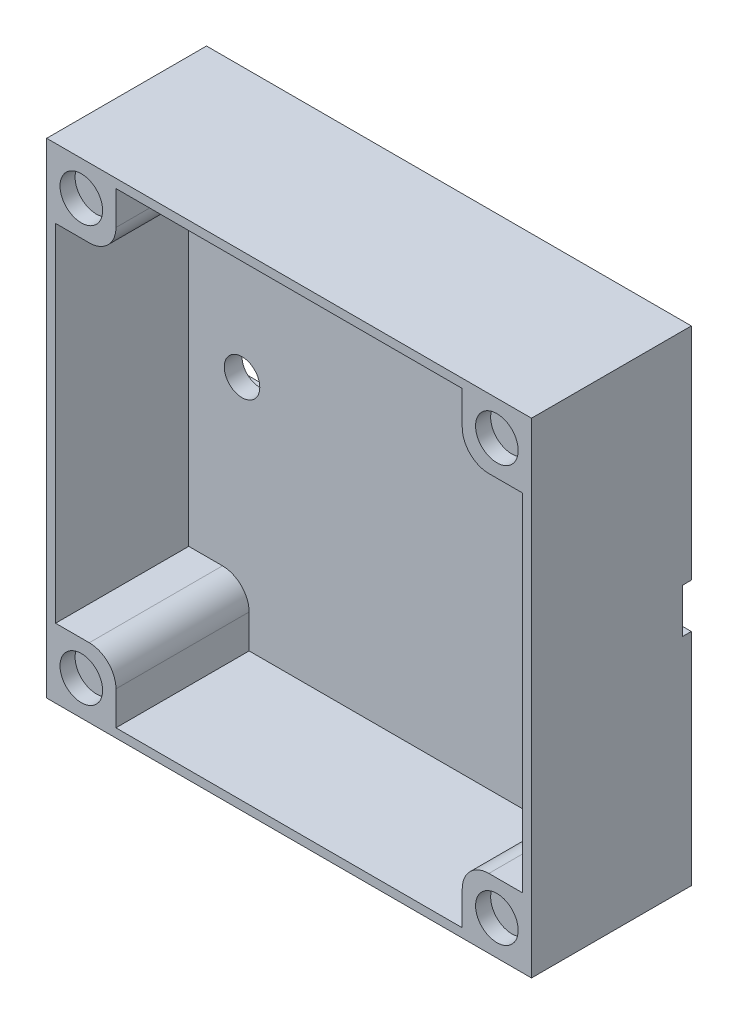
ISO-10303-21;
HEADER;
FILE_DESCRIPTION(('STEP AP214'),'2;1');
FILE_NAME('part.step','',(''),(''),'','','');
FILE_SCHEMA(('AUTOMOTIVE_DESIGN { 1 0 10303 214 1 1 1 1 }'));
ENDSEC;
DATA;
#1=APPLICATION_CONTEXT('core data for automotive mechanical design processes');
#2=APPLICATION_PROTOCOL_DEFINITION('international standard','automotive_design',2000,#1);
#3=PRODUCT_CONTEXT('',#1,'mechanical');
#4=PRODUCT('Part','Part','',(#3));
#5=PRODUCT_RELATED_PRODUCT_CATEGORY('part','',(#4));
#6=PRODUCT_DEFINITION_FORMATION('','',#4);
#7=PRODUCT_DEFINITION_CONTEXT('part definition',#1,'design');
#8=PRODUCT_DEFINITION('design','',#6,#7);
#9=PRODUCT_DEFINITION_SHAPE('','',#8);
#10=(LENGTH_UNIT() NAMED_UNIT(*) SI_UNIT(.MILLI.,.METRE.));
#11=(NAMED_UNIT(*) PLANE_ANGLE_UNIT() SI_UNIT($,.RADIAN.));
#12=(NAMED_UNIT(*) SI_UNIT($,.STERADIAN.) SOLID_ANGLE_UNIT());
#13=UNCERTAINTY_MEASURE_WITH_UNIT(LENGTH_MEASURE(1.E-05),#10,'distance_accuracy_value','');
#14=(GEOMETRIC_REPRESENTATION_CONTEXT(3) GLOBAL_UNCERTAINTY_ASSIGNED_CONTEXT((#13)) GLOBAL_UNIT_ASSIGNED_CONTEXT((#10,
#11,#12)) REPRESENTATION_CONTEXT('',''));
#15=CARTESIAN_POINT('',(0.,0.,0.));
#16=DIRECTION('',(0.,0.,1.));
#17=DIRECTION('',(1.,0.,0.));
#18=AXIS2_PLACEMENT_3D('',#15,#16,#17);
#19=CARTESIAN_POINT('',(27.3,27.3,3.));
#20=DIRECTION('',(1.,0.,0.));
#21=DIRECTION('',(0.,1.,0.));
#22=AXIS2_PLACEMENT_3D('',#19,#20,#21);
#23=PLANE('',#22);
#24=DIRECTION('',(0.,0.,-1.));
#25=VECTOR('',#24,1.);
#26=CARTESIAN_POINT('',(27.3,27.3,3.));
#27=LINE('',#26,#25);
#28=CARTESIAN_POINT('',(27.3,27.3,18.));
#29=VERTEX_POINT('',#28);
#30=CARTESIAN_POINT('',(27.3,27.3,0.));
#31=VERTEX_POINT('',#30);
#32=EDGE_CURVE('E371',#29,#31,#27,.T.);
#33=ORIENTED_EDGE('',*,*,#32,.F.);
#34=DIRECTION('',(0.,1.,0.));
#35=VECTOR('',#34,1.);
#36=CARTESIAN_POINT('',(27.3,0.,18.));
#37=LINE('',#36,#35);
#38=CARTESIAN_POINT('',(27.3,-27.3,18.));
#39=VERTEX_POINT('',#38);
#40=EDGE_CURVE('E312',#39,#29,#37,.T.);
#41=ORIENTED_EDGE('',*,*,#40,.F.);
#42=DIRECTION('',(0.,0.,-1.));
#43=VECTOR('',#42,1.);
#44=CARTESIAN_POINT('',(27.3,-27.3,3.));
#45=LINE('',#44,#43);
#46=CARTESIAN_POINT('',(27.3,-27.3,0.));
#47=VERTEX_POINT('',#46);
#48=EDGE_CURVE('E367',#39,#47,#45,.T.);
#49=ORIENTED_EDGE('',*,*,#48,.T.);
#50=DIRECTION('',(0.,-1.,0.));
#51=VECTOR('',#50,1.);
#52=CARTESIAN_POINT('',(27.3,27.3,0.));
#53=LINE('',#52,#51);
#54=CARTESIAN_POINT('',(27.3,-2.5,0.));
#55=VERTEX_POINT('',#54);
#56=EDGE_CURVE('E363',#55,#47,#53,.T.);
#57=ORIENTED_EDGE('',*,*,#56,.F.);
#58=DIRECTION('',(0.,0.,-1.));
#59=VECTOR('',#58,1.);
#60=CARTESIAN_POINT('',(27.3,-2.5,1.));
#61=LINE('',#60,#59);
#62=CARTESIAN_POINT('',(27.3,-2.5,1.));
#63=VERTEX_POINT('',#62);
#64=EDGE_CURVE('E342',#63,#55,#61,.T.);
#65=ORIENTED_EDGE('',*,*,#64,.F.);
#66=DIRECTION('',(0.,-1.,0.));
#67=VECTOR('',#66,1.);
#68=CARTESIAN_POINT('',(27.3,2.5,1.));
#69=LINE('',#68,#67);
#70=CARTESIAN_POINT('',(27.3,2.5,1.));
#71=VERTEX_POINT('',#70);
#72=EDGE_CURVE('E330',#71,#63,#69,.T.);
#73=ORIENTED_EDGE('',*,*,#72,.F.);
#74=DIRECTION('',(0.,0.,-1.));
#75=VECTOR('',#74,1.);
#76=CARTESIAN_POINT('',(27.3,2.5,1.));
#77=LINE('',#76,#75);
#78=CARTESIAN_POINT('',(27.3,2.5,0.));
#79=VERTEX_POINT('',#78);
#80=EDGE_CURVE('E346',#71,#79,#77,.T.);
#81=ORIENTED_EDGE('',*,*,#80,.T.);
#82=EDGE_CURVE('E364',#31,#79,#53,.T.);
#83=ORIENTED_EDGE('',*,*,#82,.F.);
#84=EDGE_LOOP('',(#33,#41,#49,#57,#65,#73,#81,#83));
#85=FACE_BOUND('',#84,.T.);
#86=ADVANCED_FACE('F71',(#85),#23,.T.);
#87=CARTESIAN_POINT('',(-27.3,27.3,3.));
#88=DIRECTION('',(1.,0.,0.));
#89=DIRECTION('',(0.,1.,0.));
#90=AXIS2_PLACEMENT_3D('',#87,#88,#89);
#91=PLANE('',#90);
#92=DIRECTION('',(0.,-1.,0.));
#93=VECTOR('',#92,1.);
#94=CARTESIAN_POINT('',(-27.3,27.3,0.));
#95=LINE('',#94,#93);
#96=CARTESIAN_POINT('',(-27.3,-2.5,0.));
#97=VERTEX_POINT('',#96);
#98=CARTESIAN_POINT('',(-27.3,-27.3,0.));
#99=VERTEX_POINT('',#98);
#100=EDGE_CURVE('E358',#97,#99,#95,.T.);
#101=ORIENTED_EDGE('',*,*,#100,.T.);
#102=DIRECTION('',(0.,0.,-1.));
#103=VECTOR('',#102,1.);
#104=CARTESIAN_POINT('',(-27.3,-27.3,3.));
#105=LINE('',#104,#103);
#106=CARTESIAN_POINT('',(-27.3,-27.3,18.));
#107=VERTEX_POINT('',#106);
#108=EDGE_CURVE('E366',#107,#99,#105,.T.);
#109=ORIENTED_EDGE('',*,*,#108,.F.);
#110=DIRECTION('',(0.,-1.,0.));
#111=VECTOR('',#110,1.);
#112=CARTESIAN_POINT('',(-27.3,0.,18.));
#113=LINE('',#112,#111);
#114=CARTESIAN_POINT('',(-27.3,27.3,18.));
#115=VERTEX_POINT('',#114);
#116=EDGE_CURVE('E316',#115,#107,#113,.T.);
#117=ORIENTED_EDGE('',*,*,#116,.F.);
#118=DIRECTION('',(0.,0.,-1.));
#119=VECTOR('',#118,1.);
#120=CARTESIAN_POINT('',(-27.3,27.3,3.));
#121=LINE('',#120,#119);
#122=CARTESIAN_POINT('',(-27.3,27.3,0.));
#123=VERTEX_POINT('',#122);
#124=EDGE_CURVE('E373',#115,#123,#121,.T.);
#125=ORIENTED_EDGE('',*,*,#124,.T.);
#126=CARTESIAN_POINT('',(-27.3,2.5,0.));
#127=VERTEX_POINT('',#126);
#128=EDGE_CURVE('E359',#123,#127,#95,.T.);
#129=ORIENTED_EDGE('',*,*,#128,.T.);
#130=DIRECTION('',(0.,0.,-1.));
#131=VECTOR('',#130,1.);
#132=CARTESIAN_POINT('',(-27.3,2.5,1.));
#133=LINE('',#132,#131);
#134=CARTESIAN_POINT('',(-27.3,2.5,1.));
#135=VERTEX_POINT('',#134);
#136=EDGE_CURVE('E350',#135,#127,#133,.T.);
#137=ORIENTED_EDGE('',*,*,#136,.F.);
#138=DIRECTION('',(0.,-1.,0.));
#139=VECTOR('',#138,1.);
#140=CARTESIAN_POINT('',(-27.3,2.5,1.));
#141=LINE('',#140,#139);
#142=CARTESIAN_POINT('',(-27.3,-2.5,1.));
#143=VERTEX_POINT('',#142);
#144=EDGE_CURVE('E337',#135,#143,#141,.T.);
#145=ORIENTED_EDGE('',*,*,#144,.T.);
#146=DIRECTION('',(0.,0.,-1.));
#147=VECTOR('',#146,1.);
#148=CARTESIAN_POINT('',(-27.3,-2.5,1.));
#149=LINE('',#148,#147);
#150=EDGE_CURVE('E353',#143,#97,#149,.T.);
#151=ORIENTED_EDGE('',*,*,#150,.T.);
#152=EDGE_LOOP('',(#101,#109,#117,#125,#129,#137,#145,#151));
#153=FACE_BOUND('',#152,.T.);
#154=ADVANCED_FACE('F494',(#153),#91,.F.);
#155=CARTESIAN_POINT('',(0.,0.,0.));
#156=DIRECTION('',(0.,0.,1.));
#157=DIRECTION('',(1.,0.,0.));
#158=AXIS2_PLACEMENT_3D('',#155,#156,#157);
#159=PLANE('',#158);
#160=DIRECTION('',(-1.,0.,0.));
#161=VECTOR('',#160,1.);
#162=CARTESIAN_POINT('',(27.3,2.5,0.));
#163=LINE('',#162,#161);
#164=EDGE_CURVE('E334',#79,#127,#163,.T.);
#165=ORIENTED_EDGE('',*,*,#164,.T.);
#166=ORIENTED_EDGE('',*,*,#128,.F.);
#167=DIRECTION('',(-1.,0.,0.));
#168=VECTOR('',#167,1.);
#169=CARTESIAN_POINT('',(27.3,27.3,0.));
#170=LINE('',#169,#168);
#171=EDGE_CURVE('E361',#31,#123,#170,.T.);
#172=ORIENTED_EDGE('',*,*,#171,.F.);
#173=ORIENTED_EDGE('',*,*,#82,.T.);
#174=EDGE_LOOP('',(#165,#166,#172,#173));
#175=FACE_BOUND('',#174,.T.);
#176=ADVANCED_FACE('F500',(#175),#159,.F.);
#177=CARTESIAN_POINT('',(27.3,-27.3,3.));
#178=DIRECTION('',(0.,-1.,0.));
#179=DIRECTION('',(1.,0.,0.));
#180=AXIS2_PLACEMENT_3D('',#177,#178,#179);
#181=PLANE('',#180);
#182=ORIENTED_EDGE('',*,*,#48,.F.);
#183=DIRECTION('',(1.,0.,0.));
#184=VECTOR('',#183,1.);
#185=CARTESIAN_POINT('',(0.,-27.3,18.));
#186=LINE('',#185,#184);
#187=EDGE_CURVE('E310',#107,#39,#186,.T.);
#188=ORIENTED_EDGE('',*,*,#187,.F.);
#189=ORIENTED_EDGE('',*,*,#108,.T.);
#190=DIRECTION('',(-1.,0.,0.));
#191=VECTOR('',#190,1.);
#192=CARTESIAN_POINT('',(27.3,-27.3,0.));
#193=LINE('',#192,#191);
#194=EDGE_CURVE('E349',#47,#99,#193,.T.);
#195=ORIENTED_EDGE('',*,*,#194,.F.);
#196=EDGE_LOOP('',(#182,#188,#189,#195));
#197=FACE_BOUND('',#196,.T.);
#198=ADVANCED_FACE('F510',(#197),#181,.T.);
#199=CARTESIAN_POINT('',(27.3,27.3,3.));
#200=DIRECTION('',(0.,-1.,0.));
#201=DIRECTION('',(1.,0.,0.));
#202=AXIS2_PLACEMENT_3D('',#199,#200,#201);
#203=PLANE('',#202);
#204=ORIENTED_EDGE('',*,*,#171,.T.);
#205=ORIENTED_EDGE('',*,*,#124,.F.);
#206=DIRECTION('',(-1.,0.,0.));
#207=VECTOR('',#206,1.);
#208=CARTESIAN_POINT('',(0.,27.3,18.));
#209=LINE('',#208,#207);
#210=EDGE_CURVE('E314',#29,#115,#209,.T.);
#211=ORIENTED_EDGE('',*,*,#210,.F.);
#212=ORIENTED_EDGE('',*,*,#32,.T.);
#213=EDGE_LOOP('',(#204,#205,#211,#212));
#214=FACE_BOUND('',#213,.T.);
#215=ADVANCED_FACE('F508',(#214),#203,.F.);
#216=ORIENTED_EDGE('',*,*,#194,.T.);
#217=ORIENTED_EDGE('',*,*,#100,.F.);
#218=DIRECTION('',(-1.,0.,0.));
#219=VECTOR('',#218,1.);
#220=CARTESIAN_POINT('',(27.3,-2.5,0.));
#221=LINE('',#220,#219);
#222=EDGE_CURVE('E319',#55,#97,#221,.T.);
#223=ORIENTED_EDGE('',*,*,#222,.F.);
#224=ORIENTED_EDGE('',*,*,#56,.T.);
#225=EDGE_LOOP('',(#216,#217,#223,#224));
#226=FACE_BOUND('',#225,.T.);
#227=ADVANCED_FACE('F506',(#226),#159,.F.);
#228=CARTESIAN_POINT('',(27.3,2.5,1.));
#229=DIRECTION('',(0.,-1.,0.));
#230=DIRECTION('',(0.,0.,-1.));
#231=AXIS2_PLACEMENT_3D('',#228,#229,#230);
#232=PLANE('',#231);
#233=ORIENTED_EDGE('',*,*,#164,.F.);
#234=ORIENTED_EDGE('',*,*,#80,.F.);
#235=DIRECTION('',(-1.,0.,0.));
#236=VECTOR('',#235,1.);
#237=CARTESIAN_POINT('',(27.3,2.5,1.));
#238=LINE('',#237,#236);
#239=EDGE_CURVE('E340',#71,#135,#238,.T.);
#240=ORIENTED_EDGE('',*,*,#239,.T.);
#241=ORIENTED_EDGE('',*,*,#136,.T.);
#242=EDGE_LOOP('',(#233,#234,#240,#241));
#243=FACE_BOUND('',#242,.T.);
#244=ADVANCED_FACE('F581',(#243),#232,.T.);
#245=CARTESIAN_POINT('',(27.3,-2.5,1.));
#246=DIRECTION('',(0.,-1.,0.));
#247=DIRECTION('',(0.,0.,-1.));
#248=AXIS2_PLACEMENT_3D('',#245,#246,#247);
#249=PLANE('',#248);
#250=ORIENTED_EDGE('',*,*,#222,.T.);
#251=ORIENTED_EDGE('',*,*,#150,.F.);
#252=DIRECTION('',(-1.,0.,0.));
#253=VECTOR('',#252,1.);
#254=CARTESIAN_POINT('',(27.3,-2.5,1.));
#255=LINE('',#254,#253);
#256=EDGE_CURVE('E333',#63,#143,#255,.T.);
#257=ORIENTED_EDGE('',*,*,#256,.F.);
#258=ORIENTED_EDGE('',*,*,#64,.T.);
#259=EDGE_LOOP('',(#250,#251,#257,#258));
#260=FACE_BOUND('',#259,.T.);
#261=ADVANCED_FACE('F576',(#260),#249,.F.);
#262=CARTESIAN_POINT('',(0.,0.,1.));
#263=DIRECTION('',(0.,0.,-1.));
#264=DIRECTION('',(-1.,0.,0.));
#265=AXIS2_PLACEMENT_3D('',#262,#263,#264);
#266=PLANE('',#265);
#267=CARTESIAN_POINT('',(20.3,0.,1.));
#268=DIRECTION('',(0.,0.,-1.));
#269=DIRECTION('',(-1.,0.,0.));
#270=AXIS2_PLACEMENT_3D('',#267,#268,#269);
#271=CIRCLE('',#270,2.);
#272=CARTESIAN_POINT('',(18.3,0.,1.));
#273=VERTEX_POINT('',#272);
#274=EDGE_CURVE('E299',#273,#273,#271,.T.);
#275=ORIENTED_EDGE('',*,*,#274,.F.);
#276=EDGE_LOOP('',(#275));
#277=FACE_BOUND('',#276,.T.);
#278=CARTESIAN_POINT('',(-20.3,0.,1.));
#279=DIRECTION('',(0.,0.,-1.));
#280=DIRECTION('',(-1.,0.,0.));
#281=AXIS2_PLACEMENT_3D('',#278,#279,#280);
#282=CIRCLE('',#281,2.);
#283=CARTESIAN_POINT('',(-22.3,0.,1.));
#284=VERTEX_POINT('',#283);
#285=EDGE_CURVE('E298',#284,#284,#282,.T.);
#286=ORIENTED_EDGE('',*,*,#285,.F.);
#287=EDGE_LOOP('',(#286));
#288=FACE_BOUND('',#287,.T.);
#289=ORIENTED_EDGE('',*,*,#72,.T.);
#290=ORIENTED_EDGE('',*,*,#256,.T.);
#291=ORIENTED_EDGE('',*,*,#144,.F.);
#292=ORIENTED_EDGE('',*,*,#239,.F.);
#293=EDGE_LOOP('',(#289,#290,#291,#292));
#294=FACE_BOUND('',#293,.T.);
#295=ADVANCED_FACE('F566',(#277,#288,#294),#266,.T.);
#296=CARTESIAN_POINT('',(26.3,0.,18.));
#297=DIRECTION('',(1.,0.,0.));
#298=DIRECTION('',(0.,1.,0.));
#299=AXIS2_PLACEMENT_3D('',#296,#297,#298);
#300=PLANE('',#299);
#301=DIRECTION('',(0.,-1.,0.));
#302=VECTOR('',#301,1.);
#303=CARTESIAN_POINT('',(26.3,0.,3.));
#304=LINE('',#303,#302);
#305=CARTESIAN_POINT('',(26.3,19.5,3.));
#306=VERTEX_POINT('',#305);
#307=CARTESIAN_POINT('',(26.3,-19.5,3.));
#308=VERTEX_POINT('',#307);
#309=EDGE_CURVE('E252',#306,#308,#304,.T.);
#310=ORIENTED_EDGE('',*,*,#309,.T.);
#311=DIRECTION('',(0.,0.,1.));
#312=VECTOR('',#311,1.);
#313=CARTESIAN_POINT('',(26.3,-19.5,18.));
#314=LINE('',#313,#312);
#315=CARTESIAN_POINT('',(26.3,-19.5,18.));
#316=VERTEX_POINT('',#315);
#317=EDGE_CURVE('E274',#308,#316,#314,.T.);
#318=ORIENTED_EDGE('',*,*,#317,.T.);
#319=DIRECTION('',(0.,-1.,0.));
#320=VECTOR('',#319,1.);
#321=CARTESIAN_POINT('',(26.3,0.,18.));
#322=LINE('',#321,#320);
#323=CARTESIAN_POINT('',(26.3,19.5,18.));
#324=VERTEX_POINT('',#323);
#325=EDGE_CURVE('E307',#324,#316,#322,.T.);
#326=ORIENTED_EDGE('',*,*,#325,.F.);
#327=DIRECTION('',(0.,0.,-1.));
#328=VECTOR('',#327,1.);
#329=CARTESIAN_POINT('',(26.3,19.5,18.));
#330=LINE('',#329,#328);
#331=EDGE_CURVE('E292',#324,#306,#330,.T.);
#332=ORIENTED_EDGE('',*,*,#331,.T.);
#333=EDGE_LOOP('',(#310,#318,#326,#332));
#334=FACE_BOUND('',#333,.T.);
#335=ADVANCED_FACE('F552',(#334),#300,.F.);
#336=CARTESIAN_POINT('',(-26.3,0.,18.));
#337=DIRECTION('',(1.,0.,0.));
#338=DIRECTION('',(0.,1.,0.));
#339=AXIS2_PLACEMENT_3D('',#336,#337,#338);
#340=PLANE('',#339);
#341=DIRECTION('',(0.,0.,1.));
#342=VECTOR('',#341,1.);
#343=CARTESIAN_POINT('',(-26.3,-19.5,18.));
#344=LINE('',#343,#342);
#345=CARTESIAN_POINT('',(-26.3,-19.5,3.));
#346=VERTEX_POINT('',#345);
#347=CARTESIAN_POINT('',(-26.3,-19.5,18.));
#348=VERTEX_POINT('',#347);
#349=EDGE_CURVE('E236',#346,#348,#344,.T.);
#350=ORIENTED_EDGE('',*,*,#349,.F.);
#351=DIRECTION('',(0.,-1.,0.));
#352=VECTOR('',#351,1.);
#353=CARTESIAN_POINT('',(-26.3,0.,3.));
#354=LINE('',#353,#352);
#355=CARTESIAN_POINT('',(-26.3,19.5,3.));
#356=VERTEX_POINT('',#355);
#357=EDGE_CURVE('E244',#356,#346,#354,.T.);
#358=ORIENTED_EDGE('',*,*,#357,.F.);
#359=DIRECTION('',(0.,0.,-1.));
#360=VECTOR('',#359,1.);
#361=CARTESIAN_POINT('',(-26.3,19.5,18.));
#362=LINE('',#361,#360);
#363=CARTESIAN_POINT('',(-26.3,19.5,18.));
#364=VERTEX_POINT('',#363);
#365=EDGE_CURVE('E285',#364,#356,#362,.T.);
#366=ORIENTED_EDGE('',*,*,#365,.F.);
#367=DIRECTION('',(0.,-1.,0.));
#368=VECTOR('',#367,1.);
#369=CARTESIAN_POINT('',(-26.3,0.,18.));
#370=LINE('',#369,#368);
#371=EDGE_CURVE('E256',#364,#348,#370,.T.);
#372=ORIENTED_EDGE('',*,*,#371,.T.);
#373=EDGE_LOOP('',(#350,#358,#366,#372));
#374=FACE_BOUND('',#373,.T.);
#375=ADVANCED_FACE('F254',(#374),#340,.T.);
#376=CARTESIAN_POINT('',(0.,26.3,18.));
#377=DIRECTION('',(0.,1.,0.));
#378=DIRECTION('',(0.,0.,1.));
#379=AXIS2_PLACEMENT_3D('',#376,#377,#378);
#380=PLANE('',#379);
#381=DIRECTION('',(1.,0.,0.));
#382=VECTOR('',#381,1.);
#383=CARTESIAN_POINT('',(0.,26.3,18.));
#384=LINE('',#383,#382);
#385=CARTESIAN_POINT('',(-19.5,26.3,18.));
#386=VERTEX_POINT('',#385);
#387=CARTESIAN_POINT('',(19.5,26.3,18.));
#388=VERTEX_POINT('',#387);
#389=EDGE_CURVE('E251',#386,#388,#384,.T.);
#390=ORIENTED_EDGE('',*,*,#389,.F.);
#391=DIRECTION('',(0.,0.,-1.));
#392=VECTOR('',#391,1.);
#393=CARTESIAN_POINT('',(-19.5,26.3,18.));
#394=LINE('',#393,#392);
#395=CARTESIAN_POINT('',(-19.5,26.3,3.));
#396=VERTEX_POINT('',#395);
#397=EDGE_CURVE('E282',#386,#396,#394,.T.);
#398=ORIENTED_EDGE('',*,*,#397,.T.);
#399=DIRECTION('',(1.,0.,0.));
#400=VECTOR('',#399,1.);
#401=CARTESIAN_POINT('',(0.,26.3,3.));
#402=LINE('',#401,#400);
#403=CARTESIAN_POINT('',(19.5,26.3,3.));
#404=VERTEX_POINT('',#403);
#405=EDGE_CURVE('E320',#396,#404,#402,.T.);
#406=ORIENTED_EDGE('',*,*,#405,.T.);
#407=DIRECTION('',(0.,0.,1.));
#408=VECTOR('',#407,1.);
#409=CARTESIAN_POINT('',(19.5,26.3,18.));
#410=LINE('',#409,#408);
#411=EDGE_CURVE('E295',#404,#388,#410,.T.);
#412=ORIENTED_EDGE('',*,*,#411,.T.);
#413=EDGE_LOOP('',(#390,#398,#406,#412));
#414=FACE_BOUND('',#413,.T.);
#415=ADVANCED_FACE('F475',(#414),#380,.F.);
#416=CARTESIAN_POINT('',(0.,0.,18.));
#417=DIRECTION('',(0.,0.,1.));
#418=DIRECTION('',(1.,0.,0.));
#419=AXIS2_PLACEMENT_3D('',#416,#417,#418);
#420=PLANE('',#419);
#421=CARTESIAN_POINT('',(23.4002805646626,-23.4,18.));
#422=DIRECTION('',(0.,0.,1.));
#423=DIRECTION('',(1.,0.,0.));
#424=AXIS2_PLACEMENT_3D('',#421,#422,#423);
#425=CIRCLE('',#424,2.4);
#426=CARTESIAN_POINT('',(25.8002805646626,-23.4,18.));
#427=VERTEX_POINT('',#426);
#428=EDGE_CURVE('E445',#427,#427,#425,.T.);
#429=ORIENTED_EDGE('',*,*,#428,.F.);
#430=EDGE_LOOP('',(#429));
#431=FACE_BOUND('',#430,.T.);
#432=CARTESIAN_POINT('',(23.4002805646626,23.4,18.));
#433=DIRECTION('',(0.,0.,1.));
#434=DIRECTION('',(1.,0.,0.));
#435=AXIS2_PLACEMENT_3D('',#432,#433,#434);
#436=CIRCLE('',#435,2.4);
#437=CARTESIAN_POINT('',(25.8002805646626,23.4,18.));
#438=VERTEX_POINT('',#437);
#439=EDGE_CURVE('E451',#438,#438,#436,.T.);
#440=ORIENTED_EDGE('',*,*,#439,.F.);
#441=EDGE_LOOP('',(#440));
#442=FACE_BOUND('',#441,.T.);
#443=CARTESIAN_POINT('',(-23.4,23.4,18.));
#444=DIRECTION('',(0.,0.,1.));
#445=DIRECTION('',(1.,0.,0.));
#446=AXIS2_PLACEMENT_3D('',#443,#444,#445);
#447=CIRCLE('',#446,2.4);
#448=CARTESIAN_POINT('',(-21.,23.4,18.));
#449=VERTEX_POINT('',#448);
#450=EDGE_CURVE('E457',#449,#449,#447,.T.);
#451=ORIENTED_EDGE('',*,*,#450,.F.);
#452=EDGE_LOOP('',(#451));
#453=FACE_BOUND('',#452,.T.);
#454=CARTESIAN_POINT('',(-23.4,-23.4,18.));
#455=DIRECTION('',(0.,0.,1.));
#456=DIRECTION('',(1.,0.,0.));
#457=AXIS2_PLACEMENT_3D('',#454,#455,#456);
#458=CIRCLE('',#457,2.4);
#459=CARTESIAN_POINT('',(-21.,-23.4,18.));
#460=VERTEX_POINT('',#459);
#461=EDGE_CURVE('E439',#460,#460,#458,.T.);
#462=ORIENTED_EDGE('',*,*,#461,.F.);
#463=EDGE_LOOP('',(#462));
#464=FACE_BOUND('',#463,.T.);
#465=DIRECTION('',(0.,1.,0.));
#466=VECTOR('',#465,1.);
#467=CARTESIAN_POINT('',(19.5,27.3,18.));
#468=LINE('',#467,#466);
#469=CARTESIAN_POINT('',(19.5,22.5,18.));
#470=VERTEX_POINT('',#469);
#471=EDGE_CURVE('E290',#470,#388,#468,.T.);
#472=ORIENTED_EDGE('',*,*,#471,.F.);
#473=CARTESIAN_POINT('',(22.5,22.5,18.));
#474=DIRECTION('',(0.,0.,1.));
#475=DIRECTION('',(1.,0.,0.));
#476=AXIS2_PLACEMENT_3D('',#473,#474,#475);
#477=CIRCLE('',#476,3.);
#478=CARTESIAN_POINT('',(22.5,19.5,18.));
#479=VERTEX_POINT('',#478);
#480=EDGE_CURVE('E406',#470,#479,#477,.T.);
#481=ORIENTED_EDGE('',*,*,#480,.T.);
#482=DIRECTION('',(-1.,0.,0.));
#483=VECTOR('',#482,1.);
#484=CARTESIAN_POINT('',(27.3,19.5,18.));
#485=LINE('',#484,#483);
#486=EDGE_CURVE('E287',#324,#479,#485,.T.);
#487=ORIENTED_EDGE('',*,*,#486,.F.);
#488=ORIENTED_EDGE('',*,*,#325,.T.);
#489=DIRECTION('',(1.,0.,0.));
#490=VECTOR('',#489,1.);
#491=CARTESIAN_POINT('',(27.3,-19.5,18.));
#492=LINE('',#491,#490);
#493=CARTESIAN_POINT('',(22.5,-19.5,18.));
#494=VERTEX_POINT('',#493);
#495=EDGE_CURVE('E269',#494,#316,#492,.T.);
#496=ORIENTED_EDGE('',*,*,#495,.F.);
#497=CARTESIAN_POINT('',(22.5,-22.5,18.));
#498=DIRECTION('',(0.,0.,1.));
#499=DIRECTION('',(1.,0.,0.));
#500=AXIS2_PLACEMENT_3D('',#497,#498,#499);
#501=CIRCLE('',#500,3.);
#502=CARTESIAN_POINT('',(19.5,-22.5,18.));
#503=VERTEX_POINT('',#502);
#504=EDGE_CURVE('E404',#494,#503,#501,.T.);
#505=ORIENTED_EDGE('',*,*,#504,.T.);
#506=DIRECTION('',(0.,1.,0.));
#507=VECTOR('',#506,1.);
#508=CARTESIAN_POINT('',(19.5,-27.3,18.));
#509=LINE('',#508,#507);
#510=CARTESIAN_POINT('',(19.5,-26.3,18.));
#511=VERTEX_POINT('',#510);
#512=EDGE_CURVE('E261',#511,#503,#509,.T.);
#513=ORIENTED_EDGE('',*,*,#512,.F.);
#514=DIRECTION('',(1.,0.,0.));
#515=VECTOR('',#514,1.);
#516=CARTESIAN_POINT('',(-26.3,-26.3,18.));
#517=LINE('',#516,#515);
#518=CARTESIAN_POINT('',(-19.5,-26.3,18.));
#519=VERTEX_POINT('',#518);
#520=EDGE_CURVE('E322',#519,#511,#517,.T.);
#521=ORIENTED_EDGE('',*,*,#520,.F.);
#522=DIRECTION('',(0.,-1.,0.));
#523=VECTOR('',#522,1.);
#524=CARTESIAN_POINT('',(-19.5,-27.3,18.));
#525=LINE('',#524,#523);
#526=CARTESIAN_POINT('',(-19.5,-22.5,18.));
#527=VERTEX_POINT('',#526);
#528=EDGE_CURVE('E258',#527,#519,#525,.T.);
#529=ORIENTED_EDGE('',*,*,#528,.F.);
#530=CARTESIAN_POINT('',(-22.5,-22.5,18.));
#531=DIRECTION('',(0.,0.,1.));
#532=DIRECTION('',(1.,0.,0.));
#533=AXIS2_PLACEMENT_3D('',#530,#531,#532);
#534=CIRCLE('',#533,3.);
#535=CARTESIAN_POINT('',(-22.5,-19.5,18.));
#536=VERTEX_POINT('',#535);
#537=EDGE_CURVE('E402',#527,#536,#534,.T.);
#538=ORIENTED_EDGE('',*,*,#537,.T.);
#539=DIRECTION('',(1.,0.,0.));
#540=VECTOR('',#539,1.);
#541=CARTESIAN_POINT('',(-27.3,-19.5,18.));
#542=LINE('',#541,#540);
#543=EDGE_CURVE('E263',#348,#536,#542,.T.);
#544=ORIENTED_EDGE('',*,*,#543,.F.);
#545=ORIENTED_EDGE('',*,*,#371,.F.);
#546=DIRECTION('',(-1.,0.,0.));
#547=VECTOR('',#546,1.);
#548=CARTESIAN_POINT('',(-27.3,19.5,18.));
#549=LINE('',#548,#547);
#550=CARTESIAN_POINT('',(-22.5,19.5,18.));
#551=VERTEX_POINT('',#550);
#552=EDGE_CURVE('E280',#551,#364,#549,.T.);
#553=ORIENTED_EDGE('',*,*,#552,.F.);
#554=CARTESIAN_POINT('',(-22.5,22.5,18.));
#555=DIRECTION('',(0.,0.,1.));
#556=DIRECTION('',(1.,0.,0.));
#557=AXIS2_PLACEMENT_3D('',#554,#555,#556);
#558=CIRCLE('',#557,3.);
#559=CARTESIAN_POINT('',(-19.5,22.5,18.));
#560=VERTEX_POINT('',#559);
#561=EDGE_CURVE('E400',#551,#560,#558,.T.);
#562=ORIENTED_EDGE('',*,*,#561,.T.);
#563=DIRECTION('',(0.,-1.,0.));
#564=VECTOR('',#563,1.);
#565=CARTESIAN_POINT('',(-19.5,27.3,18.));
#566=LINE('',#565,#564);
#567=EDGE_CURVE('E277',#386,#560,#566,.T.);
#568=ORIENTED_EDGE('',*,*,#567,.F.);
#569=ORIENTED_EDGE('',*,*,#389,.T.);
#570=EDGE_LOOP('',(#472,#481,#487,#488,#496,#505,#513,#521,#529,#538,#544,#545,#553,#562,#568,#569));
#571=FACE_BOUND('',#570,.T.);
#572=ORIENTED_EDGE('',*,*,#187,.T.);
#573=ORIENTED_EDGE('',*,*,#40,.T.);
#574=ORIENTED_EDGE('',*,*,#210,.T.);
#575=ORIENTED_EDGE('',*,*,#116,.T.);
#576=EDGE_LOOP('',(#572,#573,#574,#575));
#577=FACE_BOUND('',#576,.T.);
#578=ADVANCED_FACE('F434',(#431,#442,#453,#464,#571,#577),#420,.T.);
#579=CARTESIAN_POINT('',(-26.3,-26.3,18.));
#580=DIRECTION('',(0.,1.,0.));
#581=DIRECTION('',(0.,0.,1.));
#582=AXIS2_PLACEMENT_3D('',#579,#580,#581);
#583=PLANE('',#582);
#584=DIRECTION('',(0.,0.,-1.));
#585=VECTOR('',#584,1.);
#586=CARTESIAN_POINT('',(-19.5,-26.3,18.));
#587=LINE('',#586,#585);
#588=CARTESIAN_POINT('',(-19.5,-26.3,3.));
#589=VERTEX_POINT('',#588);
#590=EDGE_CURVE('E257',#519,#589,#587,.T.);
#591=ORIENTED_EDGE('',*,*,#590,.F.);
#592=ORIENTED_EDGE('',*,*,#520,.T.);
#593=DIRECTION('',(0.,0.,1.));
#594=VECTOR('',#593,1.);
#595=CARTESIAN_POINT('',(19.5,-26.3,18.));
#596=LINE('',#595,#594);
#597=CARTESIAN_POINT('',(19.5,-26.3,3.));
#598=VERTEX_POINT('',#597);
#599=EDGE_CURVE('E271',#598,#511,#596,.T.);
#600=ORIENTED_EDGE('',*,*,#599,.F.);
#601=DIRECTION('',(1.,0.,0.));
#602=VECTOR('',#601,1.);
#603=CARTESIAN_POINT('',(-26.3,-26.3,3.));
#604=LINE('',#603,#602);
#605=EDGE_CURVE('E326',#589,#598,#604,.T.);
#606=ORIENTED_EDGE('',*,*,#605,.F.);
#607=EDGE_LOOP('',(#591,#592,#600,#606));
#608=FACE_BOUND('',#607,.T.);
#609=ADVANCED_FACE('F474',(#608),#583,.T.);
#610=CARTESIAN_POINT('',(0.,0.,3.));
#611=DIRECTION('',(0.,0.,1.));
#612=DIRECTION('',(1.,0.,0.));
#613=AXIS2_PLACEMENT_3D('',#610,#611,#612);
#614=PLANE('',#613);
#615=DIRECTION('',(0.,1.,0.));
#616=VECTOR('',#615,1.);
#617=CARTESIAN_POINT('',(-19.5,0.,3.));
#618=LINE('',#617,#616);
#619=CARTESIAN_POINT('',(-19.5,-22.5,3.));
#620=VERTEX_POINT('',#619);
#621=EDGE_CURVE('E240',#589,#620,#618,.T.);
#622=ORIENTED_EDGE('',*,*,#621,.F.);
#623=ORIENTED_EDGE('',*,*,#605,.T.);
#624=DIRECTION('',(0.,-1.,0.));
#625=VECTOR('',#624,1.);
#626=CARTESIAN_POINT('',(19.5,0.,3.));
#627=LINE('',#626,#625);
#628=CARTESIAN_POINT('',(19.5,-22.5,3.));
#629=VERTEX_POINT('',#628);
#630=EDGE_CURVE('E389',#629,#598,#627,.T.);
#631=ORIENTED_EDGE('',*,*,#630,.F.);
#632=CARTESIAN_POINT('',(22.5,-22.5,3.));
#633=DIRECTION('',(0.,0.,1.));
#634=DIRECTION('',(1.,0.,0.));
#635=AXIS2_PLACEMENT_3D('',#632,#633,#634);
#636=CIRCLE('',#635,3.);
#637=CARTESIAN_POINT('',(22.5,-19.5,3.));
#638=VERTEX_POINT('',#637);
#639=EDGE_CURVE('E422',#629,#638,#636,.F.);
#640=ORIENTED_EDGE('',*,*,#639,.T.);
#641=DIRECTION('',(-1.,0.,0.));
#642=VECTOR('',#641,1.);
#643=CARTESIAN_POINT('',(0.,-19.5,3.));
#644=LINE('',#643,#642);
#645=EDGE_CURVE('E241',#308,#638,#644,.T.);
#646=ORIENTED_EDGE('',*,*,#645,.F.);
#647=ORIENTED_EDGE('',*,*,#309,.F.);
#648=DIRECTION('',(1.,0.,0.));
#649=VECTOR('',#648,1.);
#650=CARTESIAN_POINT('',(0.,19.5,3.));
#651=LINE('',#650,#649);
#652=CARTESIAN_POINT('',(22.5,19.5,3.));
#653=VERTEX_POINT('',#652);
#654=EDGE_CURVE('E370',#653,#306,#651,.T.);
#655=ORIENTED_EDGE('',*,*,#654,.F.);
#656=CARTESIAN_POINT('',(22.5,22.5,3.));
#657=DIRECTION('',(0.,0.,1.));
#658=DIRECTION('',(1.,0.,0.));
#659=AXIS2_PLACEMENT_3D('',#656,#657,#658);
#660=CIRCLE('',#659,3.);
#661=CARTESIAN_POINT('',(19.5,22.5,3.));
#662=VERTEX_POINT('',#661);
#663=EDGE_CURVE('E420',#653,#662,#660,.F.);
#664=ORIENTED_EDGE('',*,*,#663,.T.);
#665=DIRECTION('',(0.,-1.,0.));
#666=VECTOR('',#665,1.);
#667=CARTESIAN_POINT('',(19.5,0.,3.));
#668=LINE('',#667,#666);
#669=EDGE_CURVE('E383',#404,#662,#668,.T.);
#670=ORIENTED_EDGE('',*,*,#669,.F.);
#671=ORIENTED_EDGE('',*,*,#405,.F.);
#672=DIRECTION('',(0.,1.,0.));
#673=VECTOR('',#672,1.);
#674=CARTESIAN_POINT('',(-19.5,0.,3.));
#675=LINE('',#674,#673);
#676=CARTESIAN_POINT('',(-19.5,22.5,3.));
#677=VERTEX_POINT('',#676);
#678=EDGE_CURVE('E386',#677,#396,#675,.T.);
#679=ORIENTED_EDGE('',*,*,#678,.F.);
#680=CARTESIAN_POINT('',(-22.5,22.5,3.));
#681=DIRECTION('',(0.,0.,1.));
#682=DIRECTION('',(1.,0.,0.));
#683=AXIS2_PLACEMENT_3D('',#680,#681,#682);
#684=CIRCLE('',#683,3.);
#685=CARTESIAN_POINT('',(-22.5,19.5,3.));
#686=VERTEX_POINT('',#685);
#687=EDGE_CURVE('E12',#677,#686,#684,.F.);
#688=ORIENTED_EDGE('',*,*,#687,.T.);
#689=DIRECTION('',(1.,0.,0.));
#690=VECTOR('',#689,1.);
#691=CARTESIAN_POINT('',(0.,19.5,3.));
#692=LINE('',#691,#690);
#693=EDGE_CURVE('E247',#356,#686,#692,.T.);
#694=ORIENTED_EDGE('',*,*,#693,.F.);
#695=ORIENTED_EDGE('',*,*,#357,.T.);
#696=DIRECTION('',(-1.,0.,0.));
#697=VECTOR('',#696,1.);
#698=CARTESIAN_POINT('',(0.,-19.5,3.));
#699=LINE('',#698,#697);
#700=CARTESIAN_POINT('',(-22.5,-19.5,3.));
#701=VERTEX_POINT('',#700);
#702=EDGE_CURVE('E231',#701,#346,#699,.T.);
#703=ORIENTED_EDGE('',*,*,#702,.F.);
#704=CARTESIAN_POINT('',(-22.5,-22.5,3.));
#705=DIRECTION('',(0.,0.,1.));
#706=DIRECTION('',(1.,0.,0.));
#707=AXIS2_PLACEMENT_3D('',#704,#705,#706);
#708=CIRCLE('',#707,3.);
#709=EDGE_CURVE('E79',#701,#620,#708,.F.);
#710=ORIENTED_EDGE('',*,*,#709,.T.);
#711=EDGE_LOOP('',(#622,#623,#631,#640,#646,#647,#655,#664,#670,#671,#679,#688,#694,#695,#703,#710));
#712=FACE_BOUND('',#711,.T.);
#713=CARTESIAN_POINT('',(20.3,0.,3.));
#714=DIRECTION('',(0.,0.,1.));
#715=DIRECTION('',(1.,0.,0.));
#716=AXIS2_PLACEMENT_3D('',#713,#714,#715);
#717=CIRCLE('',#716,2.);
#718=CARTESIAN_POINT('',(22.3,0.,3.));
#719=VERTEX_POINT('',#718);
#720=EDGE_CURVE('E329',#719,#719,#717,.T.);
#721=ORIENTED_EDGE('',*,*,#720,.F.);
#722=EDGE_LOOP('',(#721));
#723=FACE_BOUND('',#722,.T.);
#724=CARTESIAN_POINT('',(-20.3,0.,3.));
#725=DIRECTION('',(0.,0.,1.));
#726=DIRECTION('',(1.,0.,0.));
#727=AXIS2_PLACEMENT_3D('',#724,#725,#726);
#728=CIRCLE('',#727,2.);
#729=CARTESIAN_POINT('',(-18.3,0.,3.));
#730=VERTEX_POINT('',#729);
#731=EDGE_CURVE('E302',#730,#730,#728,.T.);
#732=ORIENTED_EDGE('',*,*,#731,.F.);
#733=EDGE_LOOP('',(#732));
#734=FACE_BOUND('',#733,.T.);
#735=ADVANCED_FACE('F245',(#712,#723,#734),#614,.T.);
#736=CARTESIAN_POINT('',(-20.3,0.,5.));
#737=DIRECTION('',(0.,0.,-1.));
#738=DIRECTION('',(-1.,0.,0.));
#739=AXIS2_PLACEMENT_3D('',#736,#737,#738);
#740=CYLINDRICAL_SURFACE('',#739,2.);
#741=ORIENTED_EDGE('',*,*,#731,.T.);
#742=EDGE_LOOP('',(#741));
#743=FACE_BOUND('',#742,.T.);
#744=ORIENTED_EDGE('',*,*,#285,.T.);
#745=EDGE_LOOP('',(#744));
#746=FACE_BOUND('',#745,.T.);
#747=ADVANCED_FACE('F570',(#743,#746),#740,.F.);
#748=CARTESIAN_POINT('',(20.3,0.,5.));
#749=DIRECTION('',(0.,0.,-1.));
#750=DIRECTION('',(-1.,0.,0.));
#751=AXIS2_PLACEMENT_3D('',#748,#749,#750);
#752=CYLINDRICAL_SURFACE('',#751,2.);
#753=ORIENTED_EDGE('',*,*,#720,.T.);
#754=EDGE_LOOP('',(#753));
#755=FACE_BOUND('',#754,.T.);
#756=ORIENTED_EDGE('',*,*,#274,.T.);
#757=EDGE_LOOP('',(#756));
#758=FACE_BOUND('',#757,.T.);
#759=ADVANCED_FACE('F755',(#755,#758),#752,.F.);
#760=CARTESIAN_POINT('',(19.5,27.3,18.));
#761=DIRECTION('',(-1.,0.,0.));
#762=DIRECTION('',(0.,0.,1.));
#763=AXIS2_PLACEMENT_3D('',#760,#761,#762);
#764=PLANE('',#763);
#765=ORIENTED_EDGE('',*,*,#669,.T.);
#766=DIRECTION('',(0.,0.,-1.));
#767=VECTOR('',#766,1.);
#768=CARTESIAN_POINT('',(19.5,22.5,18.));
#769=LINE('',#768,#767);
#770=EDGE_CURVE('E398',#662,#470,#769,.F.);
#771=ORIENTED_EDGE('',*,*,#770,.T.);
#772=ORIENTED_EDGE('',*,*,#471,.T.);
#773=ORIENTED_EDGE('',*,*,#411,.F.);
#774=EDGE_LOOP('',(#765,#771,#772,#773));
#775=FACE_BOUND('',#774,.T.);
#776=ADVANCED_FACE('F751',(#775),#764,.T.);
#777=CARTESIAN_POINT('',(27.3,19.5,18.));
#778=DIRECTION('',(0.,-1.,0.));
#779=DIRECTION('',(0.,0.,-1.));
#780=AXIS2_PLACEMENT_3D('',#777,#778,#779);
#781=PLANE('',#780);
#782=ORIENTED_EDGE('',*,*,#486,.T.);
#783=DIRECTION('',(0.,0.,-1.));
#784=VECTOR('',#783,1.);
#785=CARTESIAN_POINT('',(22.5,19.5,18.));
#786=LINE('',#785,#784);
#787=EDGE_CURVE('E395',#479,#653,#786,.T.);
#788=ORIENTED_EDGE('',*,*,#787,.T.);
#789=ORIENTED_EDGE('',*,*,#654,.T.);
#790=ORIENTED_EDGE('',*,*,#331,.F.);
#791=EDGE_LOOP('',(#782,#788,#789,#790));
#792=FACE_BOUND('',#791,.T.);
#793=ADVANCED_FACE('F547',(#792),#781,.T.);
#794=CARTESIAN_POINT('',(-19.5,27.3,18.));
#795=DIRECTION('',(1.,0.,0.));
#796=DIRECTION('',(0.,0.,-1.));
#797=AXIS2_PLACEMENT_3D('',#794,#795,#796);
#798=PLANE('',#797);
#799=ORIENTED_EDGE('',*,*,#567,.T.);
#800=DIRECTION('',(0.,0.,-1.));
#801=VECTOR('',#800,1.);
#802=CARTESIAN_POINT('',(-19.5,22.5,18.));
#803=LINE('',#802,#801);
#804=EDGE_CURVE('E416',#560,#677,#803,.T.);
#805=ORIENTED_EDGE('',*,*,#804,.T.);
#806=ORIENTED_EDGE('',*,*,#678,.T.);
#807=ORIENTED_EDGE('',*,*,#397,.F.);
#808=EDGE_LOOP('',(#799,#805,#806,#807));
#809=FACE_BOUND('',#808,.T.);
#810=ADVANCED_FACE('F535',(#809),#798,.T.);
#811=CARTESIAN_POINT('',(-27.3,19.5,18.));
#812=DIRECTION('',(0.,-1.,0.));
#813=DIRECTION('',(0.,0.,-1.));
#814=AXIS2_PLACEMENT_3D('',#811,#812,#813);
#815=PLANE('',#814);
#816=ORIENTED_EDGE('',*,*,#693,.T.);
#817=DIRECTION('',(0.,0.,-1.));
#818=VECTOR('',#817,1.);
#819=CARTESIAN_POINT('',(-22.5,19.5,18.));
#820=LINE('',#819,#818);
#821=EDGE_CURVE('E418',#686,#551,#820,.F.);
#822=ORIENTED_EDGE('',*,*,#821,.T.);
#823=ORIENTED_EDGE('',*,*,#552,.T.);
#824=ORIENTED_EDGE('',*,*,#365,.T.);
#825=EDGE_LOOP('',(#816,#822,#823,#824));
#826=FACE_BOUND('',#825,.T.);
#827=ADVANCED_FACE('F773',(#826),#815,.T.);
#828=CARTESIAN_POINT('',(27.3,-19.5,18.));
#829=DIRECTION('',(0.,1.,0.));
#830=DIRECTION('',(0.,0.,1.));
#831=AXIS2_PLACEMENT_3D('',#828,#829,#830);
#832=PLANE('',#831);
#833=ORIENTED_EDGE('',*,*,#645,.T.);
#834=DIRECTION('',(0.,0.,-1.));
#835=VECTOR('',#834,1.);
#836=CARTESIAN_POINT('',(22.5,-19.5,18.));
#837=LINE('',#836,#835);
#838=EDGE_CURVE('E411',#638,#494,#837,.F.);
#839=ORIENTED_EDGE('',*,*,#838,.T.);
#840=ORIENTED_EDGE('',*,*,#495,.T.);
#841=ORIENTED_EDGE('',*,*,#317,.F.);
#842=EDGE_LOOP('',(#833,#839,#840,#841));
#843=FACE_BOUND('',#842,.T.);
#844=ADVANCED_FACE('F782',(#843),#832,.T.);
#845=CARTESIAN_POINT('',(19.5,-27.3,18.));
#846=DIRECTION('',(-1.,0.,0.));
#847=DIRECTION('',(0.,0.,1.));
#848=AXIS2_PLACEMENT_3D('',#845,#846,#847);
#849=PLANE('',#848);
#850=ORIENTED_EDGE('',*,*,#512,.T.);
#851=DIRECTION('',(0.,0.,-1.));
#852=VECTOR('',#851,1.);
#853=CARTESIAN_POINT('',(19.5,-22.5,18.));
#854=LINE('',#853,#852);
#855=EDGE_CURVE('E408',#503,#629,#854,.T.);
#856=ORIENTED_EDGE('',*,*,#855,.T.);
#857=ORIENTED_EDGE('',*,*,#630,.T.);
#858=ORIENTED_EDGE('',*,*,#599,.T.);
#859=EDGE_LOOP('',(#850,#856,#857,#858));
#860=FACE_BOUND('',#859,.T.);
#861=ADVANCED_FACE('F561',(#860),#849,.T.);
#862=CARTESIAN_POINT('',(-19.5,-27.3,18.));
#863=DIRECTION('',(1.,0.,0.));
#864=DIRECTION('',(0.,0.,-1.));
#865=AXIS2_PLACEMENT_3D('',#862,#863,#864);
#866=PLANE('',#865);
#867=ORIENTED_EDGE('',*,*,#621,.T.);
#868=DIRECTION('',(0.,0.,-1.));
#869=VECTOR('',#868,1.);
#870=CARTESIAN_POINT('',(-19.5,-22.5,18.));
#871=LINE('',#870,#869);
#872=EDGE_CURVE('E414',#620,#527,#871,.F.);
#873=ORIENTED_EDGE('',*,*,#872,.T.);
#874=ORIENTED_EDGE('',*,*,#528,.T.);
#875=ORIENTED_EDGE('',*,*,#590,.T.);
#876=EDGE_LOOP('',(#867,#873,#874,#875));
#877=FACE_BOUND('',#876,.T.);
#878=ADVANCED_FACE('F427',(#877),#866,.T.);
#879=CARTESIAN_POINT('',(-27.3,-19.5,18.));
#880=DIRECTION('',(0.,1.,0.));
#881=DIRECTION('',(0.,0.,1.));
#882=AXIS2_PLACEMENT_3D('',#879,#880,#881);
#883=PLANE('',#882);
#884=ORIENTED_EDGE('',*,*,#543,.T.);
#885=DIRECTION('',(0.,0.,-1.));
#886=VECTOR('',#885,1.);
#887=CARTESIAN_POINT('',(-22.5,-19.5,18.));
#888=LINE('',#887,#886);
#889=EDGE_CURVE('E239',#536,#701,#888,.T.);
#890=ORIENTED_EDGE('',*,*,#889,.T.);
#891=ORIENTED_EDGE('',*,*,#702,.T.);
#892=ORIENTED_EDGE('',*,*,#349,.T.);
#893=EDGE_LOOP('',(#884,#890,#891,#892));
#894=FACE_BOUND('',#893,.T.);
#895=ADVANCED_FACE('F234',(#894),#883,.T.);
#896=CARTESIAN_POINT('',(-23.4,-23.4,16.3));
#897=DIRECTION('',(0.,0.,1.));
#898=DIRECTION('',(1.,0.,0.));
#899=AXIS2_PLACEMENT_3D('',#896,#897,#898);
#900=CYLINDRICAL_SURFACE('',#899,2.4);
#901=CARTESIAN_POINT('',(-23.4,-23.4,16.3));
#902=DIRECTION('',(0.,0.,1.));
#903=DIRECTION('',(1.,0.,0.));
#904=AXIS2_PLACEMENT_3D('',#901,#902,#903);
#905=CIRCLE('',#904,2.4);
#906=CARTESIAN_POINT('',(-21.,-23.4,16.3));
#907=VERTEX_POINT('',#906);
#908=EDGE_CURVE('E437',#907,#907,#905,.T.);
#909=ORIENTED_EDGE('',*,*,#908,.F.);
#910=EDGE_LOOP('',(#909));
#911=FACE_BOUND('',#910,.T.);
#912=ORIENTED_EDGE('',*,*,#461,.T.);
#913=EDGE_LOOP('',(#912));
#914=FACE_BOUND('',#913,.T.);
#915=ADVANCED_FACE('F480',(#911,#914),#900,.F.);
#916=CARTESIAN_POINT('',(-23.4,-23.4,16.3));
#917=DIRECTION('',(0.,0.,1.));
#918=DIRECTION('',(1.,0.,0.));
#919=AXIS2_PLACEMENT_3D('',#916,#917,#918);
#920=PLANE('',#919);
#921=ORIENTED_EDGE('',*,*,#908,.T.);
#922=EDGE_LOOP('',(#921));
#923=FACE_BOUND('',#922,.T.);
#924=ADVANCED_FACE('F468',(#923),#920,.T.);
#925=CARTESIAN_POINT('',(-23.4,23.4,16.3));
#926=DIRECTION('',(0.,0.,1.));
#927=DIRECTION('',(1.,0.,0.));
#928=AXIS2_PLACEMENT_3D('',#925,#926,#927);
#929=CYLINDRICAL_SURFACE('',#928,2.4);
#930=CARTESIAN_POINT('',(-23.4,23.4,16.3));
#931=DIRECTION('',(0.,0.,1.));
#932=DIRECTION('',(1.,0.,0.));
#933=AXIS2_PLACEMENT_3D('',#930,#931,#932);
#934=CIRCLE('',#933,2.4);
#935=CARTESIAN_POINT('',(-21.,23.4,16.3));
#936=VERTEX_POINT('',#935);
#937=EDGE_CURVE('E443',#936,#936,#934,.T.);
#938=ORIENTED_EDGE('',*,*,#937,.F.);
#939=EDGE_LOOP('',(#938));
#940=FACE_BOUND('',#939,.T.);
#941=ORIENTED_EDGE('',*,*,#450,.T.);
#942=EDGE_LOOP('',(#941));
#943=FACE_BOUND('',#942,.T.);
#944=ADVANCED_FACE('F465',(#940,#943),#929,.F.);
#945=CARTESIAN_POINT('',(-23.4,23.4,16.3));
#946=DIRECTION('',(0.,0.,1.));
#947=DIRECTION('',(1.,0.,0.));
#948=AXIS2_PLACEMENT_3D('',#945,#946,#947);
#949=PLANE('',#948);
#950=ORIENTED_EDGE('',*,*,#937,.T.);
#951=EDGE_LOOP('',(#950));
#952=FACE_BOUND('',#951,.T.);
#953=ADVANCED_FACE('F463',(#952),#949,.T.);
#954=CARTESIAN_POINT('',(23.4002805646626,23.4,16.3));
#955=DIRECTION('',(0.,0.,1.));
#956=DIRECTION('',(1.,0.,0.));
#957=AXIS2_PLACEMENT_3D('',#954,#955,#956);
#958=CYLINDRICAL_SURFACE('',#957,2.4);
#959=CARTESIAN_POINT('',(23.4002805646626,23.4,16.3));
#960=DIRECTION('',(0.,0.,1.));
#961=DIRECTION('',(1.,0.,0.));
#962=AXIS2_PLACEMENT_3D('',#959,#960,#961);
#963=CIRCLE('',#962,2.4);
#964=CARTESIAN_POINT('',(25.8002805646626,23.4,16.3));
#965=VERTEX_POINT('',#964);
#966=EDGE_CURVE('E454',#965,#965,#963,.T.);
#967=ORIENTED_EDGE('',*,*,#966,.F.);
#968=EDGE_LOOP('',(#967));
#969=FACE_BOUND('',#968,.T.);
#970=ORIENTED_EDGE('',*,*,#439,.T.);
#971=EDGE_LOOP('',(#970));
#972=FACE_BOUND('',#971,.T.);
#973=ADVANCED_FACE('F690',(#969,#972),#958,.F.);
#974=CARTESIAN_POINT('',(23.4002805646626,23.4,16.3));
#975=DIRECTION('',(0.,0.,1.));
#976=DIRECTION('',(1.,0.,0.));
#977=AXIS2_PLACEMENT_3D('',#974,#975,#976);
#978=PLANE('',#977);
#979=ORIENTED_EDGE('',*,*,#966,.T.);
#980=EDGE_LOOP('',(#979));
#981=FACE_BOUND('',#980,.T.);
#982=ADVANCED_FACE('F699',(#981),#978,.T.);
#983=CARTESIAN_POINT('',(23.4002805646626,-23.4,16.3));
#984=DIRECTION('',(0.,0.,1.));
#985=DIRECTION('',(1.,0.,0.));
#986=AXIS2_PLACEMENT_3D('',#983,#984,#985);
#987=CYLINDRICAL_SURFACE('',#986,2.4);
#988=CARTESIAN_POINT('',(23.4002805646626,-23.4,16.3));
#989=DIRECTION('',(0.,0.,1.));
#990=DIRECTION('',(1.,0.,0.));
#991=AXIS2_PLACEMENT_3D('',#988,#989,#990);
#992=CIRCLE('',#991,2.4);
#993=CARTESIAN_POINT('',(25.8002805646626,-23.4,16.3));
#994=VERTEX_POINT('',#993);
#995=EDGE_CURVE('E448',#994,#994,#992,.T.);
#996=ORIENTED_EDGE('',*,*,#995,.F.);
#997=EDGE_LOOP('',(#996));
#998=FACE_BOUND('',#997,.T.);
#999=ORIENTED_EDGE('',*,*,#428,.T.);
#1000=EDGE_LOOP('',(#999));
#1001=FACE_BOUND('',#1000,.T.);
#1002=ADVANCED_FACE('F709',(#998,#1001),#987,.F.);
#1003=CARTESIAN_POINT('',(23.4002805646626,-23.4,16.3));
#1004=DIRECTION('',(0.,0.,1.));
#1005=DIRECTION('',(1.,0.,0.));
#1006=AXIS2_PLACEMENT_3D('',#1003,#1004,#1005);
#1007=PLANE('',#1006);
#1008=ORIENTED_EDGE('',*,*,#995,.T.);
#1009=EDGE_LOOP('',(#1008));
#1010=FACE_BOUND('',#1009,.T.);
#1011=ADVANCED_FACE('F520',(#1010),#1007,.T.);
#1012=CARTESIAN_POINT('',(22.5,22.5,18.));
#1013=DIRECTION('',(0.,0.,-1.));
#1014=DIRECTION('',(-1.,0.,0.));
#1015=AXIS2_PLACEMENT_3D('',#1012,#1013,#1014);
#1016=CYLINDRICAL_SURFACE('',#1015,3.);
#1017=ORIENTED_EDGE('',*,*,#480,.F.);
#1018=ORIENTED_EDGE('',*,*,#770,.F.);
#1019=ORIENTED_EDGE('',*,*,#663,.F.);
#1020=ORIENTED_EDGE('',*,*,#787,.F.);
#1021=EDGE_LOOP('',(#1017,#1018,#1019,#1020));
#1022=FACE_BOUND('',#1021,.T.);
#1023=ADVANCED_FACE('F516',(#1022),#1016,.T.);
#1024=CARTESIAN_POINT('',(22.5,-22.5,18.));
#1025=DIRECTION('',(0.,0.,-1.));
#1026=DIRECTION('',(-1.,0.,0.));
#1027=AXIS2_PLACEMENT_3D('',#1024,#1025,#1026);
#1028=CYLINDRICAL_SURFACE('',#1027,3.);
#1029=ORIENTED_EDGE('',*,*,#504,.F.);
#1030=ORIENTED_EDGE('',*,*,#838,.F.);
#1031=ORIENTED_EDGE('',*,*,#639,.F.);
#1032=ORIENTED_EDGE('',*,*,#855,.F.);
#1033=EDGE_LOOP('',(#1029,#1030,#1031,#1032));
#1034=FACE_BOUND('',#1033,.T.);
#1035=ADVANCED_FACE('F519',(#1034),#1028,.T.);
#1036=CARTESIAN_POINT('',(-22.5,-22.5,18.));
#1037=DIRECTION('',(0.,0.,-1.));
#1038=DIRECTION('',(-1.,0.,0.));
#1039=AXIS2_PLACEMENT_3D('',#1036,#1037,#1038);
#1040=CYLINDRICAL_SURFACE('',#1039,3.);
#1041=ORIENTED_EDGE('',*,*,#537,.F.);
#1042=ORIENTED_EDGE('',*,*,#872,.F.);
#1043=ORIENTED_EDGE('',*,*,#709,.F.);
#1044=ORIENTED_EDGE('',*,*,#889,.F.);
#1045=EDGE_LOOP('',(#1041,#1042,#1043,#1044));
#1046=FACE_BOUND('',#1045,.T.);
#1047=ADVANCED_FACE('F431',(#1046),#1040,.T.);
#1048=CARTESIAN_POINT('',(-22.5,22.5,18.));
#1049=DIRECTION('',(0.,0.,-1.));
#1050=DIRECTION('',(-1.,0.,0.));
#1051=AXIS2_PLACEMENT_3D('',#1048,#1049,#1050);
#1052=CYLINDRICAL_SURFACE('',#1051,3.);
#1053=ORIENTED_EDGE('',*,*,#561,.F.);
#1054=ORIENTED_EDGE('',*,*,#821,.F.);
#1055=ORIENTED_EDGE('',*,*,#687,.F.);
#1056=ORIENTED_EDGE('',*,*,#804,.F.);
#1057=EDGE_LOOP('',(#1053,#1054,#1055,#1056));
#1058=FACE_BOUND('',#1057,.T.);
#1059=ADVANCED_FACE('F73',(#1058),#1052,.T.);
#1060=CLOSED_SHELL('',(#86,#154,#176,#198,#215,#227,#244,#261,#295,#335,#375,#415,#578,#609,
#735,#747,#759,#776,#793,#810,#827,#844,#861,#878,#895,#915,#924,#944,#953,#973,#982,#1002,
#1011,#1023,#1035,#1047,#1059));
#1061=MANIFOLD_SOLID_BREP('B2',#1060);
#1062=ADVANCED_BREP_SHAPE_REPRESENTATION('',(#18,#1061),#14);
#1063=SHAPE_DEFINITION_REPRESENTATION(#9,#1062);
ENDSEC;
END-ISO-10303-21;
